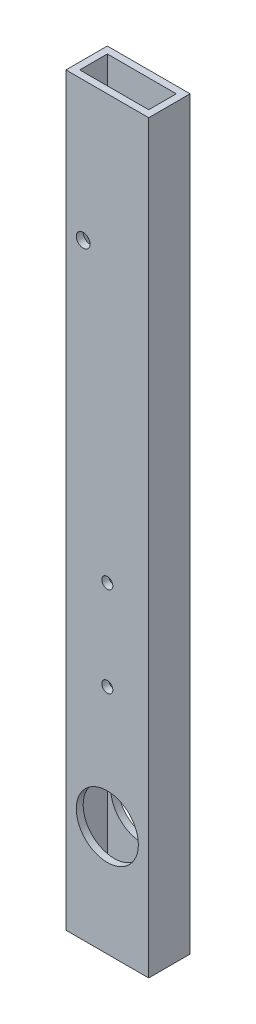
ISO-10303-21;
HEADER;
FILE_DESCRIPTION(('STEP AP214'),'2;1');
FILE_NAME('part.step','',(''),(''),'','','');
FILE_SCHEMA(('AUTOMOTIVE_DESIGN { 1 0 10303 214 1 1 1 1 }'));
ENDSEC;
DATA;
#1=APPLICATION_CONTEXT('core data for automotive mechanical design processes');
#2=APPLICATION_PROTOCOL_DEFINITION('international standard','automotive_design',2000,#1);
#3=PRODUCT_CONTEXT('',#1,'mechanical');
#4=PRODUCT('Part','Part','',(#3));
#5=PRODUCT_RELATED_PRODUCT_CATEGORY('part','',(#4));
#6=PRODUCT_DEFINITION_FORMATION('','',#4);
#7=PRODUCT_DEFINITION_CONTEXT('part definition',#1,'design');
#8=PRODUCT_DEFINITION('design','',#6,#7);
#9=PRODUCT_DEFINITION_SHAPE('','',#8);
#10=(LENGTH_UNIT() NAMED_UNIT(*) SI_UNIT(.MILLI.,.METRE.));
#11=(NAMED_UNIT(*) PLANE_ANGLE_UNIT() SI_UNIT($,.RADIAN.));
#12=(NAMED_UNIT(*) SI_UNIT($,.STERADIAN.) SOLID_ANGLE_UNIT());
#13=UNCERTAINTY_MEASURE_WITH_UNIT(LENGTH_MEASURE(1.E-05),#10,'distance_accuracy_value','');
#14=(GEOMETRIC_REPRESENTATION_CONTEXT(3) GLOBAL_UNCERTAINTY_ASSIGNED_CONTEXT((#13)) GLOBAL_UNIT_ASSIGNED_CONTEXT((#10,
#11,#12)) REPRESENTATION_CONTEXT('',''));
#15=CARTESIAN_POINT('',(0.,0.,0.));
#16=DIRECTION('',(0.,0.,1.));
#17=DIRECTION('',(1.,0.,0.));
#18=AXIS2_PLACEMENT_3D('',#15,#16,#17);
#19=CARTESIAN_POINT('',(0.,342.9,0.));
#20=DIRECTION('',(0.,-1.,0.));
#21=DIRECTION('',(0.,0.,-1.));
#22=AXIS2_PLACEMENT_3D('',#19,#20,#21);
#23=PLANE('',#22);
#24=DIRECTION('',(0.,0.,1.));
#25=VECTOR('',#24,1.);
#26=CARTESIAN_POINT('',(0.,342.9,0.));
#27=LINE('',#26,#25);
#28=CARTESIAN_POINT('',(0.,342.9,-19.05));
#29=VERTEX_POINT('',#28);
#30=CARTESIAN_POINT('',(0.,342.9,0.));
#31=VERTEX_POINT('',#30);
#32=EDGE_CURVE('E159',#29,#31,#27,.T.);
#33=ORIENTED_EDGE('',*,*,#32,.T.);
#34=DIRECTION('',(1.,0.,0.));
#35=VECTOR('',#34,1.);
#36=CARTESIAN_POINT('',(0.,342.9,0.));
#37=LINE('',#36,#35);
#38=CARTESIAN_POINT('',(38.1,342.9,0.));
#39=VERTEX_POINT('',#38);
#40=EDGE_CURVE('E163',#31,#39,#37,.T.);
#41=ORIENTED_EDGE('',*,*,#40,.T.);
#42=DIRECTION('',(0.,0.,-1.));
#43=VECTOR('',#42,1.);
#44=CARTESIAN_POINT('',(38.1,342.9,0.));
#45=LINE('',#44,#43);
#46=CARTESIAN_POINT('',(38.1,342.9,-19.05));
#47=VERTEX_POINT('',#46);
#48=EDGE_CURVE('E167',#39,#47,#45,.T.);
#49=ORIENTED_EDGE('',*,*,#48,.T.);
#50=DIRECTION('',(-1.,0.,0.));
#51=VECTOR('',#50,1.);
#52=CARTESIAN_POINT('',(0.,342.9,-19.05));
#53=LINE('',#52,#51);
#54=EDGE_CURVE('E169',#47,#29,#53,.T.);
#55=ORIENTED_EDGE('',*,*,#54,.T.);
#56=EDGE_LOOP('',(#33,#41,#49,#55));
#57=FACE_BOUND('',#56,.T.);
#58=DIRECTION('',(0.,0.,1.));
#59=VECTOR('',#58,1.);
#60=CARTESIAN_POINT('',(3.175,342.9,-3.175));
#61=LINE('',#60,#59);
#62=CARTESIAN_POINT('',(3.175,342.9,-15.875));
#63=VERTEX_POINT('',#62);
#64=CARTESIAN_POINT('',(3.175,342.9,-3.175));
#65=VERTEX_POINT('',#64);
#66=EDGE_CURVE('E112',#63,#65,#61,.T.);
#67=ORIENTED_EDGE('',*,*,#66,.F.);
#68=DIRECTION('',(-1.,0.,0.));
#69=VECTOR('',#68,1.);
#70=CARTESIAN_POINT('',(3.175,342.9,-15.875));
#71=LINE('',#70,#69);
#72=CARTESIAN_POINT('',(34.925,342.9,-15.875));
#73=VERTEX_POINT('',#72);
#74=EDGE_CURVE('E138',#73,#63,#71,.T.);
#75=ORIENTED_EDGE('',*,*,#74,.F.);
#76=DIRECTION('',(0.,0.,-1.));
#77=VECTOR('',#76,1.);
#78=CARTESIAN_POINT('',(34.925,342.9,-3.175));
#79=LINE('',#78,#77);
#80=CARTESIAN_POINT('',(34.925,342.9,-3.175));
#81=VERTEX_POINT('',#80);
#82=EDGE_CURVE('E134',#81,#73,#79,.T.);
#83=ORIENTED_EDGE('',*,*,#82,.F.);
#84=DIRECTION('',(1.,0.,0.));
#85=VECTOR('',#84,1.);
#86=CARTESIAN_POINT('',(3.175,342.9,-3.175));
#87=LINE('',#86,#85);
#88=EDGE_CURVE('E121',#65,#81,#87,.T.);
#89=ORIENTED_EDGE('',*,*,#88,.F.);
#90=EDGE_LOOP('',(#67,#75,#83,#89));
#91=FACE_BOUND('',#90,.T.);
#92=ADVANCED_FACE('F38',(#57,#91),#23,.F.);
#93=CARTESIAN_POINT('',(0.,0.,0.));
#94=DIRECTION('',(0.,-1.,0.));
#95=DIRECTION('',(0.,0.,-1.));
#96=AXIS2_PLACEMENT_3D('',#93,#94,#95);
#97=PLANE('',#96);
#98=DIRECTION('',(0.,0.,1.));
#99=VECTOR('',#98,1.);
#100=CARTESIAN_POINT('',(0.,0.,0.));
#101=LINE('',#100,#99);
#102=CARTESIAN_POINT('',(0.,0.,-19.05));
#103=VERTEX_POINT('',#102);
#104=CARTESIAN_POINT('',(0.,0.,0.));
#105=VERTEX_POINT('',#104);
#106=EDGE_CURVE('E130',#103,#105,#101,.T.);
#107=ORIENTED_EDGE('',*,*,#106,.F.);
#108=DIRECTION('',(-1.,0.,0.));
#109=VECTOR('',#108,1.);
#110=CARTESIAN_POINT('',(0.,0.,-19.05));
#111=LINE('',#110,#109);
#112=CARTESIAN_POINT('',(38.1,0.,-19.05));
#113=VERTEX_POINT('',#112);
#114=EDGE_CURVE('E164',#113,#103,#111,.T.);
#115=ORIENTED_EDGE('',*,*,#114,.F.);
#116=DIRECTION('',(0.,0.,-1.));
#117=VECTOR('',#116,1.);
#118=CARTESIAN_POINT('',(38.1,0.,0.));
#119=LINE('',#118,#117);
#120=CARTESIAN_POINT('',(38.1,0.,0.));
#121=VERTEX_POINT('',#120);
#122=EDGE_CURVE('E178',#121,#113,#119,.T.);
#123=ORIENTED_EDGE('',*,*,#122,.F.);
#124=DIRECTION('',(1.,0.,0.));
#125=VECTOR('',#124,1.);
#126=CARTESIAN_POINT('',(0.,0.,0.));
#127=LINE('',#126,#125);
#128=EDGE_CURVE('E175',#105,#121,#127,.T.);
#129=ORIENTED_EDGE('',*,*,#128,.F.);
#130=EDGE_LOOP('',(#107,#115,#123,#129));
#131=FACE_BOUND('',#130,.T.);
#132=DIRECTION('',(-1.,0.,0.));
#133=VECTOR('',#132,1.);
#134=CARTESIAN_POINT('',(3.175,0.,-15.875));
#135=LINE('',#134,#133);
#136=CARTESIAN_POINT('',(34.925,0.,-15.875));
#137=VERTEX_POINT('',#136);
#138=CARTESIAN_POINT('',(3.175,0.,-15.875));
#139=VERTEX_POINT('',#138);
#140=EDGE_CURVE('E122',#137,#139,#135,.T.);
#141=ORIENTED_EDGE('',*,*,#140,.T.);
#142=DIRECTION('',(0.,0.,1.));
#143=VECTOR('',#142,1.);
#144=CARTESIAN_POINT('',(3.175,0.,-3.175));
#145=LINE('',#144,#143);
#146=CARTESIAN_POINT('',(3.175,0.,-3.175));
#147=VERTEX_POINT('',#146);
#148=EDGE_CURVE('E64',#139,#147,#145,.T.);
#149=ORIENTED_EDGE('',*,*,#148,.T.);
#150=DIRECTION('',(1.,0.,0.));
#151=VECTOR('',#150,1.);
#152=CARTESIAN_POINT('',(3.175,0.,-3.175));
#153=LINE('',#152,#151);
#154=CARTESIAN_POINT('',(34.925,0.,-3.175));
#155=VERTEX_POINT('',#154);
#156=EDGE_CURVE('E128',#147,#155,#153,.T.);
#157=ORIENTED_EDGE('',*,*,#156,.T.);
#158=DIRECTION('',(0.,0.,-1.));
#159=VECTOR('',#158,1.);
#160=CARTESIAN_POINT('',(34.925,0.,-3.175));
#161=LINE('',#160,#159);
#162=EDGE_CURVE('E147',#155,#137,#161,.T.);
#163=ORIENTED_EDGE('',*,*,#162,.T.);
#164=EDGE_LOOP('',(#141,#149,#157,#163));
#165=FACE_BOUND('',#164,.T.);
#166=ADVANCED_FACE('F272',(#131,#165),#97,.T.);
#167=CARTESIAN_POINT('',(0.,342.9,0.));
#168=DIRECTION('',(1.,0.,0.));
#169=DIRECTION('',(0.,0.,-1.));
#170=AXIS2_PLACEMENT_3D('',#167,#168,#169);
#171=PLANE('',#170);
#172=ORIENTED_EDGE('',*,*,#106,.T.);
#173=DIRECTION('',(0.,-1.,0.));
#174=VECTOR('',#173,1.);
#175=CARTESIAN_POINT('',(0.,342.9,0.));
#176=LINE('',#175,#174);
#177=EDGE_CURVE('E11',#31,#105,#176,.T.);
#178=ORIENTED_EDGE('',*,*,#177,.F.);
#179=ORIENTED_EDGE('',*,*,#32,.F.);
#180=DIRECTION('',(0.,-1.,0.));
#181=VECTOR('',#180,1.);
#182=CARTESIAN_POINT('',(0.,342.9,-19.05));
#183=LINE('',#182,#181);
#184=EDGE_CURVE('E172',#29,#103,#183,.T.);
#185=ORIENTED_EDGE('',*,*,#184,.T.);
#186=EDGE_LOOP('',(#172,#178,#179,#185));
#187=FACE_BOUND('',#186,.T.);
#188=ADVANCED_FACE('F40',(#187),#171,.F.);
#189=CARTESIAN_POINT('',(0.,342.9,0.));
#190=DIRECTION('',(0.,0.,-1.));
#191=DIRECTION('',(-1.,0.,0.));
#192=AXIS2_PLACEMENT_3D('',#189,#190,#191);
#193=PLANE('',#192);
#194=CARTESIAN_POINT('',(19.05,147.996272786042,0.));
#195=DIRECTION('',(0.,0.,-1.));
#196=DIRECTION('',(-1.,0.,0.));
#197=AXIS2_PLACEMENT_3D('',#194,#195,#196);
#198=CIRCLE('',#197,2.54);
#199=CARTESIAN_POINT('',(16.51,147.996272786042,0.));
#200=VERTEX_POINT('',#199);
#201=EDGE_CURVE('E206',#200,#200,#198,.T.);
#202=ORIENTED_EDGE('',*,*,#201,.T.);
#203=EDGE_LOOP('',(#202));
#204=FACE_BOUND('',#203,.T.);
#205=CARTESIAN_POINT('',(7.94671084808515,278.981271675796,0.));
#206=DIRECTION('',(0.,0.,-1.));
#207=DIRECTION('',(-1.,0.,0.));
#208=AXIS2_PLACEMENT_3D('',#205,#206,#207);
#209=CIRCLE('',#208,3.175);
#210=CARTESIAN_POINT('',(4.77171084808515,278.981271675796,0.));
#211=VERTEX_POINT('',#210);
#212=EDGE_CURVE('E222',#211,#211,#209,.T.);
#213=ORIENTED_EDGE('',*,*,#212,.T.);
#214=EDGE_LOOP('',(#213));
#215=FACE_BOUND('',#214,.T.);
#216=CARTESIAN_POINT('',(19.05,106.541886393021,0.));
#217=DIRECTION('',(0.,0.,-1.));
#218=DIRECTION('',(-1.,0.,0.));
#219=AXIS2_PLACEMENT_3D('',#216,#217,#218);
#220=CIRCLE('',#219,2.54);
#221=CARTESIAN_POINT('',(16.51,106.541886393021,0.));
#222=VERTEX_POINT('',#221);
#223=EDGE_CURVE('E201',#222,#222,#220,.T.);
#224=ORIENTED_EDGE('',*,*,#223,.T.);
#225=EDGE_LOOP('',(#224));
#226=FACE_BOUND('',#225,.T.);
#227=CARTESIAN_POINT('',(19.05,50.8,0.));
#228=DIRECTION('',(0.,0.,1.));
#229=DIRECTION('',(1.,0.,0.));
#230=AXIS2_PLACEMENT_3D('',#227,#228,#229);
#231=CIRCLE('',#230,14.2875);
#232=CARTESIAN_POINT('',(33.3375,50.8,0.));
#233=VERTEX_POINT('',#232);
#234=EDGE_CURVE('E243',#233,#233,#231,.T.);
#235=ORIENTED_EDGE('',*,*,#234,.F.);
#236=EDGE_LOOP('',(#235));
#237=FACE_BOUND('',#236,.T.);
#238=ORIENTED_EDGE('',*,*,#128,.T.);
#239=DIRECTION('',(0.,-1.,0.));
#240=VECTOR('',#239,1.);
#241=CARTESIAN_POINT('',(38.1,342.9,0.));
#242=LINE('',#241,#240);
#243=EDGE_CURVE('E48',#39,#121,#242,.T.);
#244=ORIENTED_EDGE('',*,*,#243,.F.);
#245=ORIENTED_EDGE('',*,*,#40,.F.);
#246=ORIENTED_EDGE('',*,*,#177,.T.);
#247=EDGE_LOOP('',(#238,#244,#245,#246));
#248=FACE_BOUND('',#247,.T.);
#249=ADVANCED_FACE('F286',(#204,#215,#226,#237,#248),#193,.F.);
#250=CARTESIAN_POINT('',(38.1,342.9,0.));
#251=DIRECTION('',(-1.,0.,0.));
#252=DIRECTION('',(0.,0.,1.));
#253=AXIS2_PLACEMENT_3D('',#250,#251,#252);
#254=PLANE('',#253);
#255=ORIENTED_EDGE('',*,*,#122,.T.);
#256=DIRECTION('',(0.,-1.,0.));
#257=VECTOR('',#256,1.);
#258=CARTESIAN_POINT('',(38.1,342.9,-19.05));
#259=LINE('',#258,#257);
#260=EDGE_CURVE('E185',#47,#113,#259,.T.);
#261=ORIENTED_EDGE('',*,*,#260,.F.);
#262=ORIENTED_EDGE('',*,*,#48,.F.);
#263=ORIENTED_EDGE('',*,*,#243,.T.);
#264=EDGE_LOOP('',(#255,#261,#262,#263));
#265=FACE_BOUND('',#264,.T.);
#266=ADVANCED_FACE('F283',(#265),#254,.F.);
#267=CARTESIAN_POINT('',(0.,342.9,-19.05));
#268=DIRECTION('',(0.,0.,1.));
#269=DIRECTION('',(1.,0.,0.));
#270=AXIS2_PLACEMENT_3D('',#267,#268,#269);
#271=PLANE('',#270);
#272=CARTESIAN_POINT('',(19.05,147.996272786042,-19.05));
#273=DIRECTION('',(0.,0.,-1.));
#274=DIRECTION('',(-1.,0.,0.));
#275=AXIS2_PLACEMENT_3D('',#272,#273,#274);
#276=CIRCLE('',#275,2.54);
#277=CARTESIAN_POINT('',(16.51,147.996272786042,-19.05));
#278=VERTEX_POINT('',#277);
#279=EDGE_CURVE('E215',#278,#278,#276,.T.);
#280=ORIENTED_EDGE('',*,*,#279,.F.);
#281=EDGE_LOOP('',(#280));
#282=FACE_BOUND('',#281,.T.);
#283=CARTESIAN_POINT('',(7.94671084808515,278.981271675796,-19.05));
#284=DIRECTION('',(0.,0.,-1.));
#285=DIRECTION('',(-1.,0.,0.));
#286=AXIS2_PLACEMENT_3D('',#283,#284,#285);
#287=CIRCLE('',#286,3.175);
#288=CARTESIAN_POINT('',(4.77171084808515,278.981271675796,-19.05));
#289=VERTEX_POINT('',#288);
#290=EDGE_CURVE('E228',#289,#289,#287,.T.);
#291=ORIENTED_EDGE('',*,*,#290,.F.);
#292=EDGE_LOOP('',(#291));
#293=FACE_BOUND('',#292,.T.);
#294=CARTESIAN_POINT('',(19.05,106.541886393021,-19.05));
#295=DIRECTION('',(0.,0.,-1.));
#296=DIRECTION('',(-1.,0.,0.));
#297=AXIS2_PLACEMENT_3D('',#294,#295,#296);
#298=CIRCLE('',#297,2.54);
#299=CARTESIAN_POINT('',(16.51,106.541886393021,-19.05));
#300=VERTEX_POINT('',#299);
#301=EDGE_CURVE('E234',#300,#300,#298,.T.);
#302=ORIENTED_EDGE('',*,*,#301,.F.);
#303=EDGE_LOOP('',(#302));
#304=FACE_BOUND('',#303,.T.);
#305=CARTESIAN_POINT('',(19.05,50.8,-19.05));
#306=DIRECTION('',(0.,0.,1.));
#307=DIRECTION('',(1.,0.,0.));
#308=AXIS2_PLACEMENT_3D('',#305,#306,#307);
#309=CIRCLE('',#308,14.2875);
#310=CARTESIAN_POINT('',(33.3375,50.8,-19.05));
#311=VERTEX_POINT('',#310);
#312=EDGE_CURVE('E196',#311,#311,#309,.T.);
#313=ORIENTED_EDGE('',*,*,#312,.T.);
#314=EDGE_LOOP('',(#313));
#315=FACE_BOUND('',#314,.T.);
#316=ORIENTED_EDGE('',*,*,#114,.T.);
#317=ORIENTED_EDGE('',*,*,#184,.F.);
#318=ORIENTED_EDGE('',*,*,#54,.F.);
#319=ORIENTED_EDGE('',*,*,#260,.T.);
#320=EDGE_LOOP('',(#316,#317,#318,#319));
#321=FACE_BOUND('',#320,.T.);
#322=ADVANCED_FACE('F267',(#282,#293,#304,#315,#321),#271,.F.);
#323=CARTESIAN_POINT('',(3.175,342.9,-3.175));
#324=DIRECTION('',(1.,0.,0.));
#325=DIRECTION('',(0.,0.,-1.));
#326=AXIS2_PLACEMENT_3D('',#323,#324,#325);
#327=PLANE('',#326);
#328=ORIENTED_EDGE('',*,*,#148,.F.);
#329=DIRECTION('',(0.,-1.,0.));
#330=VECTOR('',#329,1.);
#331=CARTESIAN_POINT('',(3.175,342.9,-15.875));
#332=LINE('',#331,#330);
#333=EDGE_CURVE('E116',#63,#139,#332,.T.);
#334=ORIENTED_EDGE('',*,*,#333,.F.);
#335=ORIENTED_EDGE('',*,*,#66,.T.);
#336=DIRECTION('',(0.,-1.,0.));
#337=VECTOR('',#336,1.);
#338=CARTESIAN_POINT('',(3.175,342.9,-3.175));
#339=LINE('',#338,#337);
#340=EDGE_CURVE('E115',#65,#147,#339,.T.);
#341=ORIENTED_EDGE('',*,*,#340,.T.);
#342=EDGE_LOOP('',(#328,#334,#335,#341));
#343=FACE_BOUND('',#342,.T.);
#344=ADVANCED_FACE('F114',(#343),#327,.T.);
#345=CARTESIAN_POINT('',(3.175,342.9,-3.175));
#346=DIRECTION('',(0.,0.,-1.));
#347=DIRECTION('',(-1.,0.,0.));
#348=AXIS2_PLACEMENT_3D('',#345,#346,#347);
#349=PLANE('',#348);
#350=CARTESIAN_POINT('',(19.05,147.996272786042,-3.175));
#351=DIRECTION('',(0.,0.,-1.));
#352=DIRECTION('',(-1.,0.,0.));
#353=AXIS2_PLACEMENT_3D('',#350,#351,#352);
#354=CIRCLE('',#353,2.54);
#355=CARTESIAN_POINT('',(16.51,147.996272786042,-3.175));
#356=VERTEX_POINT('',#355);
#357=EDGE_CURVE('E231',#356,#356,#354,.T.);
#358=ORIENTED_EDGE('',*,*,#357,.F.);
#359=EDGE_LOOP('',(#358));
#360=FACE_BOUND('',#359,.T.);
#361=CARTESIAN_POINT('',(7.94671084808515,278.981271675796,-3.175));
#362=DIRECTION('',(0.,0.,-1.));
#363=DIRECTION('',(-1.,0.,0.));
#364=AXIS2_PLACEMENT_3D('',#361,#362,#363);
#365=CIRCLE('',#364,3.175);
#366=CARTESIAN_POINT('',(4.77171084808515,278.981271675796,-3.175));
#367=VERTEX_POINT('',#366);
#368=EDGE_CURVE('E205',#367,#367,#365,.T.);
#369=ORIENTED_EDGE('',*,*,#368,.F.);
#370=EDGE_LOOP('',(#369));
#371=FACE_BOUND('',#370,.T.);
#372=CARTESIAN_POINT('',(19.05,106.541886393021,-3.175));
#373=DIRECTION('',(0.,0.,-1.));
#374=DIRECTION('',(-1.,0.,0.));
#375=AXIS2_PLACEMENT_3D('',#372,#373,#374);
#376=CIRCLE('',#375,2.54);
#377=CARTESIAN_POINT('',(16.51,106.541886393021,-3.175));
#378=VERTEX_POINT('',#377);
#379=EDGE_CURVE('E200',#378,#378,#376,.T.);
#380=ORIENTED_EDGE('',*,*,#379,.F.);
#381=EDGE_LOOP('',(#380));
#382=FACE_BOUND('',#381,.T.);
#383=CARTESIAN_POINT('',(19.05,50.8,-3.175));
#384=DIRECTION('',(0.,0.,-1.));
#385=DIRECTION('',(-1.,0.,0.));
#386=AXIS2_PLACEMENT_3D('',#383,#384,#385);
#387=CIRCLE('',#386,14.2875);
#388=CARTESIAN_POINT('',(4.7625,50.8,-3.175));
#389=VERTEX_POINT('',#388);
#390=EDGE_CURVE('E144',#389,#389,#387,.T.);
#391=ORIENTED_EDGE('',*,*,#390,.F.);
#392=EDGE_LOOP('',(#391));
#393=FACE_BOUND('',#392,.T.);
#394=ORIENTED_EDGE('',*,*,#156,.F.);
#395=ORIENTED_EDGE('',*,*,#340,.F.);
#396=ORIENTED_EDGE('',*,*,#88,.T.);
#397=DIRECTION('',(0.,-1.,0.));
#398=VECTOR('',#397,1.);
#399=CARTESIAN_POINT('',(34.925,342.9,-3.175));
#400=LINE('',#399,#398);
#401=EDGE_CURVE('E131',#81,#155,#400,.T.);
#402=ORIENTED_EDGE('',*,*,#401,.T.);
#403=EDGE_LOOP('',(#394,#395,#396,#402));
#404=FACE_BOUND('',#403,.T.);
#405=ADVANCED_FACE('F125',(#360,#371,#382,#393,#404),#349,.T.);
#406=CARTESIAN_POINT('',(34.925,342.9,-3.175));
#407=DIRECTION('',(-1.,0.,0.));
#408=DIRECTION('',(0.,0.,1.));
#409=AXIS2_PLACEMENT_3D('',#406,#407,#408);
#410=PLANE('',#409);
#411=ORIENTED_EDGE('',*,*,#162,.F.);
#412=ORIENTED_EDGE('',*,*,#401,.F.);
#413=ORIENTED_EDGE('',*,*,#82,.T.);
#414=DIRECTION('',(0.,-1.,0.));
#415=VECTOR('',#414,1.);
#416=CARTESIAN_POINT('',(34.925,342.9,-15.875));
#417=LINE('',#416,#415);
#418=EDGE_CURVE('E56',#73,#137,#417,.T.);
#419=ORIENTED_EDGE('',*,*,#418,.T.);
#420=EDGE_LOOP('',(#411,#412,#413,#419));
#421=FACE_BOUND('',#420,.T.);
#422=ADVANCED_FACE('F257',(#421),#410,.T.);
#423=CARTESIAN_POINT('',(3.175,342.9,-15.875));
#424=DIRECTION('',(0.,0.,1.));
#425=DIRECTION('',(1.,0.,0.));
#426=AXIS2_PLACEMENT_3D('',#423,#424,#425);
#427=PLANE('',#426);
#428=CARTESIAN_POINT('',(19.05,147.996272786042,-15.875));
#429=DIRECTION('',(0.,0.,1.));
#430=DIRECTION('',(1.,0.,0.));
#431=AXIS2_PLACEMENT_3D('',#428,#429,#430);
#432=CIRCLE('',#431,2.54);
#433=CARTESIAN_POINT('',(21.59,147.996272786042,-15.875));
#434=VERTEX_POINT('',#433);
#435=EDGE_CURVE('E42',#434,#434,#432,.T.);
#436=ORIENTED_EDGE('',*,*,#435,.F.);
#437=EDGE_LOOP('',(#436));
#438=FACE_BOUND('',#437,.T.);
#439=CARTESIAN_POINT('',(7.94671084808515,278.981271675796,-15.875));
#440=DIRECTION('',(0.,0.,1.));
#441=DIRECTION('',(1.,0.,0.));
#442=AXIS2_PLACEMENT_3D('',#439,#440,#441);
#443=CIRCLE('',#442,3.175);
#444=CARTESIAN_POINT('',(11.1217108480851,278.981271675796,-15.875));
#445=VERTEX_POINT('',#444);
#446=EDGE_CURVE('E202',#445,#445,#443,.T.);
#447=ORIENTED_EDGE('',*,*,#446,.F.);
#448=EDGE_LOOP('',(#447));
#449=FACE_BOUND('',#448,.T.);
#450=CARTESIAN_POINT('',(19.05,106.541886393021,-15.875));
#451=DIRECTION('',(0.,0.,1.));
#452=DIRECTION('',(1.,0.,0.));
#453=AXIS2_PLACEMENT_3D('',#450,#451,#452);
#454=CIRCLE('',#453,2.54);
#455=CARTESIAN_POINT('',(21.59,106.541886393021,-15.875));
#456=VERTEX_POINT('',#455);
#457=EDGE_CURVE('E197',#456,#456,#454,.T.);
#458=ORIENTED_EDGE('',*,*,#457,.F.);
#459=EDGE_LOOP('',(#458));
#460=FACE_BOUND('',#459,.T.);
#461=CARTESIAN_POINT('',(19.05,50.8,-15.875));
#462=DIRECTION('',(0.,0.,1.));
#463=DIRECTION('',(1.,0.,0.));
#464=AXIS2_PLACEMENT_3D('',#461,#462,#463);
#465=CIRCLE('',#464,14.2875);
#466=CARTESIAN_POINT('',(33.3375,50.8,-15.875));
#467=VERTEX_POINT('',#466);
#468=EDGE_CURVE('E192',#467,#467,#465,.T.);
#469=ORIENTED_EDGE('',*,*,#468,.F.);
#470=EDGE_LOOP('',(#469));
#471=FACE_BOUND('',#470,.T.);
#472=ORIENTED_EDGE('',*,*,#140,.F.);
#473=ORIENTED_EDGE('',*,*,#418,.F.);
#474=ORIENTED_EDGE('',*,*,#74,.T.);
#475=ORIENTED_EDGE('',*,*,#333,.T.);
#476=EDGE_LOOP('',(#472,#473,#474,#475));
#477=FACE_BOUND('',#476,.T.);
#478=ADVANCED_FACE('F264',(#438,#449,#460,#471,#477),#427,.T.);
#479=CARTESIAN_POINT('',(19.05,50.8,-19.05));
#480=DIRECTION('',(0.,0.,1.));
#481=DIRECTION('',(1.,0.,0.));
#482=AXIS2_PLACEMENT_3D('',#479,#480,#481);
#483=CYLINDRICAL_SURFACE('',#482,14.2875);
#484=ORIENTED_EDGE('',*,*,#468,.T.);
#485=EDGE_LOOP('',(#484));
#486=FACE_BOUND('',#485,.T.);
#487=ORIENTED_EDGE('',*,*,#312,.F.);
#488=EDGE_LOOP('',(#487));
#489=FACE_BOUND('',#488,.T.);
#490=ADVANCED_FACE('F314',(#486,#489),#483,.F.);
#491=ORIENTED_EDGE('',*,*,#390,.T.);
#492=EDGE_LOOP('',(#491));
#493=FACE_BOUND('',#492,.T.);
#494=ORIENTED_EDGE('',*,*,#234,.T.);
#495=EDGE_LOOP('',(#494));
#496=FACE_BOUND('',#495,.T.);
#497=ADVANCED_FACE('F253',(#493,#496),#483,.F.);
#498=CARTESIAN_POINT('',(19.05,106.541886393021,0.));
#499=DIRECTION('',(0.,0.,-1.));
#500=DIRECTION('',(-1.,0.,0.));
#501=AXIS2_PLACEMENT_3D('',#498,#499,#500);
#502=CYLINDRICAL_SURFACE('',#501,2.54);
#503=ORIENTED_EDGE('',*,*,#457,.T.);
#504=EDGE_LOOP('',(#503));
#505=FACE_BOUND('',#504,.T.);
#506=ORIENTED_EDGE('',*,*,#301,.T.);
#507=EDGE_LOOP('',(#506));
#508=FACE_BOUND('',#507,.T.);
#509=ADVANCED_FACE('F325',(#505,#508),#502,.F.);
#510=ORIENTED_EDGE('',*,*,#379,.T.);
#511=EDGE_LOOP('',(#510));
#512=FACE_BOUND('',#511,.T.);
#513=ORIENTED_EDGE('',*,*,#223,.F.);
#514=EDGE_LOOP('',(#513));
#515=FACE_BOUND('',#514,.T.);
#516=ADVANCED_FACE('F328',(#512,#515),#502,.F.);
#517=CARTESIAN_POINT('',(7.94671084808515,278.981271675796,0.));
#518=DIRECTION('',(0.,0.,-1.));
#519=DIRECTION('',(-1.,0.,0.));
#520=AXIS2_PLACEMENT_3D('',#517,#518,#519);
#521=CYLINDRICAL_SURFACE('',#520,3.175);
#522=ORIENTED_EDGE('',*,*,#446,.T.);
#523=EDGE_LOOP('',(#522));
#524=FACE_BOUND('',#523,.T.);
#525=ORIENTED_EDGE('',*,*,#290,.T.);
#526=EDGE_LOOP('',(#525));
#527=FACE_BOUND('',#526,.T.);
#528=ADVANCED_FACE('F330',(#524,#527),#521,.F.);
#529=CARTESIAN_POINT('',(19.05,147.996272786042,0.));
#530=DIRECTION('',(0.,0.,-1.));
#531=DIRECTION('',(-1.,0.,0.));
#532=AXIS2_PLACEMENT_3D('',#529,#530,#531);
#533=CYLINDRICAL_SURFACE('',#532,2.54);
#534=ORIENTED_EDGE('',*,*,#435,.T.);
#535=EDGE_LOOP('',(#534));
#536=FACE_BOUND('',#535,.T.);
#537=ORIENTED_EDGE('',*,*,#279,.T.);
#538=EDGE_LOOP('',(#537));
#539=FACE_BOUND('',#538,.T.);
#540=ADVANCED_FACE('F333',(#536,#539),#533,.F.);
#541=ORIENTED_EDGE('',*,*,#368,.T.);
#542=EDGE_LOOP('',(#541));
#543=FACE_BOUND('',#542,.T.);
#544=ORIENTED_EDGE('',*,*,#212,.F.);
#545=EDGE_LOOP('',(#544));
#546=FACE_BOUND('',#545,.T.);
#547=ADVANCED_FACE('F334',(#543,#546),#521,.F.);
#548=ORIENTED_EDGE('',*,*,#357,.T.);
#549=EDGE_LOOP('',(#548));
#550=FACE_BOUND('',#549,.T.);
#551=ORIENTED_EDGE('',*,*,#201,.F.);
#552=EDGE_LOOP('',(#551));
#553=FACE_BOUND('',#552,.T.);
#554=ADVANCED_FACE('F337',(#550,#553),#533,.F.);
#555=CLOSED_SHELL('',(#92,#166,#188,#249,#266,#322,#344,#405,#422,#478,#490,#497,#509,#516,#528,
#540,#547,#554));
#556=MANIFOLD_SOLID_BREP('B2',#555);
#557=ADVANCED_BREP_SHAPE_REPRESENTATION('',(#18,#556),#14);
#558=SHAPE_DEFINITION_REPRESENTATION(#9,#557);
ENDSEC;
END-ISO-10303-21;
